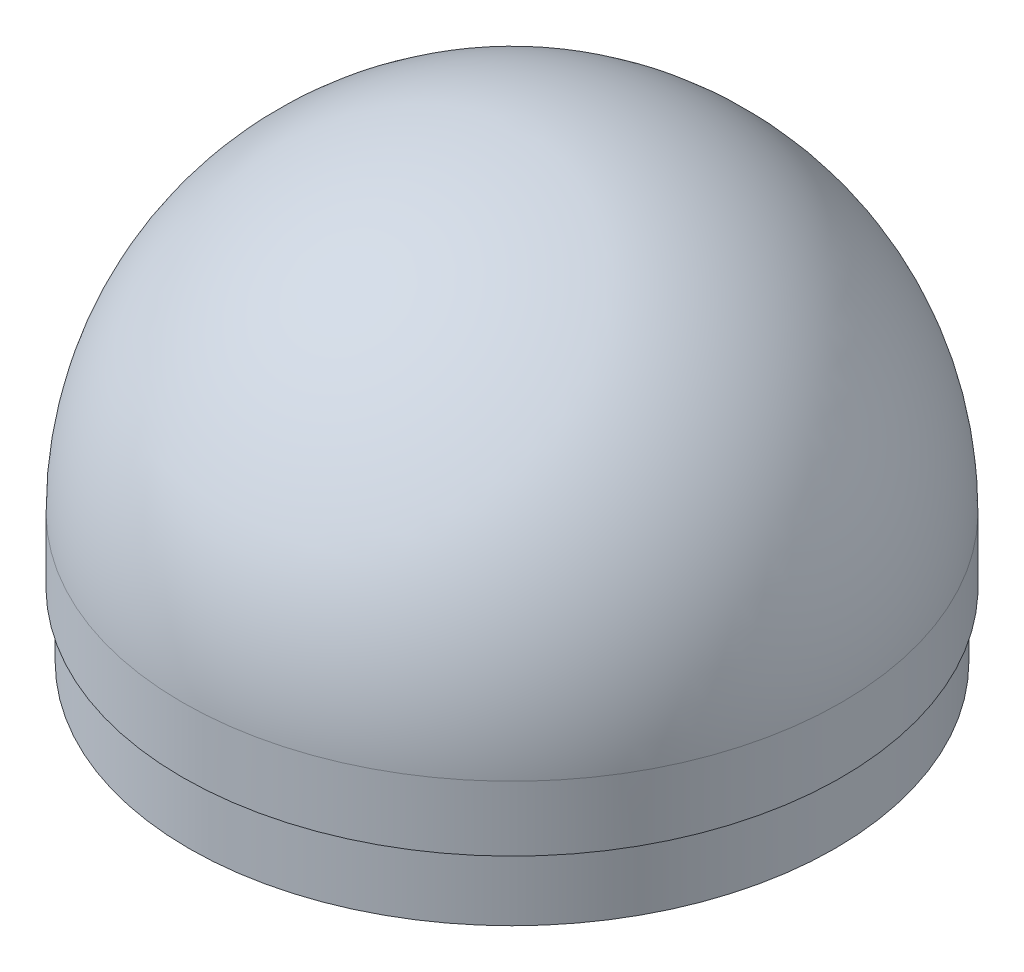
ISO-10303-21;
HEADER;
FILE_DESCRIPTION(('STEP AP214'),'2;1');
FILE_NAME('part.step','',(''),(''),'','','');
FILE_SCHEMA(('AUTOMOTIVE_DESIGN { 1 0 10303 214 1 1 1 1 }'));
ENDSEC;
DATA;
#1=APPLICATION_CONTEXT('core data for automotive mechanical design processes');
#2=APPLICATION_PROTOCOL_DEFINITION('international standard','automotive_design',2000,#1);
#3=PRODUCT_CONTEXT('',#1,'mechanical');
#4=PRODUCT('Part','Part','',(#3));
#5=PRODUCT_RELATED_PRODUCT_CATEGORY('part','',(#4));
#6=PRODUCT_DEFINITION_FORMATION('','',#4);
#7=PRODUCT_DEFINITION_CONTEXT('part definition',#1,'design');
#8=PRODUCT_DEFINITION('design','',#6,#7);
#9=PRODUCT_DEFINITION_SHAPE('','',#8);
#10=(LENGTH_UNIT() NAMED_UNIT(*) SI_UNIT(.MILLI.,.METRE.));
#11=(NAMED_UNIT(*) PLANE_ANGLE_UNIT() SI_UNIT($,.RADIAN.));
#12=(NAMED_UNIT(*) SI_UNIT($,.STERADIAN.) SOLID_ANGLE_UNIT());
#13=UNCERTAINTY_MEASURE_WITH_UNIT(LENGTH_MEASURE(1.E-05),#10,'distance_accuracy_value','');
#14=(GEOMETRIC_REPRESENTATION_CONTEXT(3) GLOBAL_UNCERTAINTY_ASSIGNED_CONTEXT((#13)) GLOBAL_UNIT_ASSIGNED_CONTEXT((#10,
#11,#12)) REPRESENTATION_CONTEXT('',''));
#15=CARTESIAN_POINT('',(0.,0.,0.));
#16=DIRECTION('',(0.,0.,1.));
#17=DIRECTION('',(1.,0.,0.));
#18=AXIS2_PLACEMENT_3D('',#15,#16,#17);
#19=CARTESIAN_POINT('',(0.,1000.,0.));
#20=DIRECTION('',(0.,1.,0.));
#21=DIRECTION('',(1.,0.,0.));
#22=AXIS2_PLACEMENT_3D('',#19,#20,#21);
#23=SPHERICAL_SURFACE('',#22,127.);
#24=CARTESIAN_POINT('',(0.,1000.,0.));
#25=DIRECTION('',(0.,1.,0.));
#26=DIRECTION('',(0.,0.,1.));
#27=AXIS2_PLACEMENT_3D('',#24,#25,#26);
#28=CIRCLE('',#27,127.);
#29=CARTESIAN_POINT('',(0.,1000.,127.));
#30=VERTEX_POINT('',#29);
#31=EDGE_CURVE('E53',#30,#30,#28,.T.);
#32=ORIENTED_EDGE('',*,*,#31,.T.);
#33=EDGE_LOOP('',(#32));
#34=FACE_BOUND('',#33,.T.);
#35=ADVANCED_FACE('F31',(#34),#23,.T.);
#36=CARTESIAN_POINT('',(0.,1000.,0.));
#37=DIRECTION('',(0.,1.,0.));
#38=DIRECTION('',(1.,0.,0.));
#39=AXIS2_PLACEMENT_3D('',#36,#37,#38);
#40=SPHERICAL_SURFACE('',#39,122.);
#41=CARTESIAN_POINT('',(0.,1000.,0.));
#42=DIRECTION('',(0.,1.,0.));
#43=DIRECTION('',(0.,0.,1.));
#44=AXIS2_PLACEMENT_3D('',#41,#42,#43);
#45=CIRCLE('',#44,122.);
#46=CARTESIAN_POINT('',(0.,1000.,122.));
#47=VERTEX_POINT('',#46);
#48=EDGE_CURVE('E10',#47,#47,#45,.T.);
#49=ORIENTED_EDGE('',*,*,#48,.F.);
#50=EDGE_LOOP('',(#49));
#51=FACE_BOUND('',#50,.T.);
#52=ADVANCED_FACE('F83',(#51),#40,.F.);
#53=CARTESIAN_POINT('',(0.,1000.,0.));
#54=DIRECTION('',(0.,1.,0.));
#55=DIRECTION('',(0.,0.,1.));
#56=AXIS2_PLACEMENT_3D('',#53,#54,#55);
#57=CYLINDRICAL_SURFACE('',#56,122.);
#58=CARTESIAN_POINT('',(0.,950.,0.));
#59=DIRECTION('',(0.,1.,0.));
#60=DIRECTION('',(0.,0.,1.));
#61=AXIS2_PLACEMENT_3D('',#58,#59,#60);
#62=CIRCLE('',#61,122.);
#63=CARTESIAN_POINT('',(0.,950.,122.));
#64=VERTEX_POINT('',#63);
#65=EDGE_CURVE('E37',#64,#64,#62,.T.);
#66=ORIENTED_EDGE('',*,*,#65,.F.);
#67=EDGE_LOOP('',(#66));
#68=FACE_BOUND('',#67,.T.);
#69=ORIENTED_EDGE('',*,*,#48,.T.);
#70=EDGE_LOOP('',(#69));
#71=FACE_BOUND('',#70,.T.);
#72=ADVANCED_FACE('F78',(#68,#71),#57,.F.);
#73=CARTESIAN_POINT('',(124.5,950.,0.));
#74=DIRECTION('',(0.,1.,0.));
#75=DIRECTION('',(0.,0.,1.));
#76=AXIS2_PLACEMENT_3D('',#73,#74,#75);
#77=PLANE('',#76);
#78=CARTESIAN_POINT('',(0.,950.,0.));
#79=DIRECTION('',(0.,1.,0.));
#80=DIRECTION('',(0.,0.,1.));
#81=AXIS2_PLACEMENT_3D('',#78,#79,#80);
#82=CIRCLE('',#81,124.5);
#83=CARTESIAN_POINT('',(0.,950.,124.5));
#84=VERTEX_POINT('',#83);
#85=EDGE_CURVE('E41',#84,#84,#82,.T.);
#86=ORIENTED_EDGE('',*,*,#85,.F.);
#87=EDGE_LOOP('',(#86));
#88=FACE_BOUND('',#87,.T.);
#89=ORIENTED_EDGE('',*,*,#65,.T.);
#90=EDGE_LOOP('',(#89));
#91=FACE_BOUND('',#90,.T.);
#92=ADVANCED_FACE('F73',(#88,#91),#77,.F.);
#93=CARTESIAN_POINT('',(0.,1000.,0.));
#94=DIRECTION('',(0.,1.,0.));
#95=DIRECTION('',(0.,0.,1.));
#96=AXIS2_PLACEMENT_3D('',#93,#94,#95);
#97=CYLINDRICAL_SURFACE('',#96,124.5);
#98=CARTESIAN_POINT('',(0.,975.,0.));
#99=DIRECTION('',(0.,1.,0.));
#100=DIRECTION('',(0.,0.,1.));
#101=AXIS2_PLACEMENT_3D('',#98,#99,#100);
#102=CIRCLE('',#101,124.5);
#103=CARTESIAN_POINT('',(0.,975.,124.5));
#104=VERTEX_POINT('',#103);
#105=EDGE_CURVE('E45',#104,#104,#102,.T.);
#106=ORIENTED_EDGE('',*,*,#105,.F.);
#107=EDGE_LOOP('',(#106));
#108=FACE_BOUND('',#107,.T.);
#109=ORIENTED_EDGE('',*,*,#85,.T.);
#110=EDGE_LOOP('',(#109));
#111=FACE_BOUND('',#110,.T.);
#112=ADVANCED_FACE('F67',(#108,#111),#97,.T.);
#113=CARTESIAN_POINT('',(127.,975.,0.));
#114=DIRECTION('',(0.,1.,0.));
#115=DIRECTION('',(0.,0.,1.));
#116=AXIS2_PLACEMENT_3D('',#113,#114,#115);
#117=PLANE('',#116);
#118=CARTESIAN_POINT('',(0.,975.,0.));
#119=DIRECTION('',(0.,1.,0.));
#120=DIRECTION('',(0.,0.,1.));
#121=AXIS2_PLACEMENT_3D('',#118,#119,#120);
#122=CIRCLE('',#121,127.);
#123=CARTESIAN_POINT('',(0.,975.,127.));
#124=VERTEX_POINT('',#123);
#125=EDGE_CURVE('E50',#124,#124,#122,.T.);
#126=ORIENTED_EDGE('',*,*,#125,.F.);
#127=EDGE_LOOP('',(#126));
#128=FACE_BOUND('',#127,.T.);
#129=ORIENTED_EDGE('',*,*,#105,.T.);
#130=EDGE_LOOP('',(#129));
#131=FACE_BOUND('',#130,.T.);
#132=ADVANCED_FACE('F61',(#128,#131),#117,.F.);
#133=CARTESIAN_POINT('',(0.,1000.,0.));
#134=DIRECTION('',(0.,1.,0.));
#135=DIRECTION('',(0.,0.,1.));
#136=AXIS2_PLACEMENT_3D('',#133,#134,#135);
#137=CYLINDRICAL_SURFACE('',#136,127.);
#138=ORIENTED_EDGE('',*,*,#31,.F.);
#139=EDGE_LOOP('',(#138));
#140=FACE_BOUND('',#139,.T.);
#141=ORIENTED_EDGE('',*,*,#125,.T.);
#142=EDGE_LOOP('',(#141));
#143=FACE_BOUND('',#142,.T.);
#144=ADVANCED_FACE('F58',(#140,#143),#137,.T.);
#145=CLOSED_SHELL('',(#35,#52,#72,#92,#112,#132,#144));
#146=MANIFOLD_SOLID_BREP('B2',#145);
#147=ADVANCED_BREP_SHAPE_REPRESENTATION('',(#18,#146),#14);
#148=SHAPE_DEFINITION_REPRESENTATION(#9,#147);
ENDSEC;
END-ISO-10303-21;
